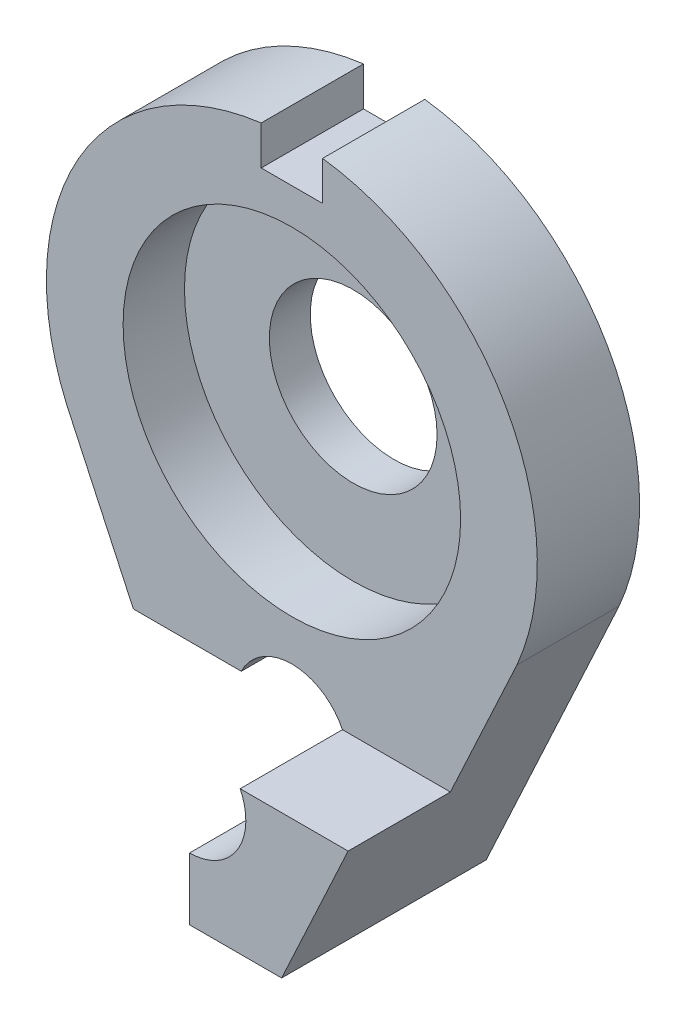
ISO-10303-21;
HEADER;
FILE_DESCRIPTION(('STEP AP214'),'2;1');
FILE_NAME('part.step','',(''),(''),'','','');
FILE_SCHEMA(('AUTOMOTIVE_DESIGN { 1 0 10303 214 1 1 1 1 }'));
ENDSEC;
DATA;
#1=APPLICATION_CONTEXT('core data for automotive mechanical design processes');
#2=APPLICATION_PROTOCOL_DEFINITION('international standard','automotive_design',2000,#1);
#3=PRODUCT_CONTEXT('',#1,'mechanical');
#4=PRODUCT('Part','Part','',(#3));
#5=PRODUCT_RELATED_PRODUCT_CATEGORY('part','',(#4));
#6=PRODUCT_DEFINITION_FORMATION('','',#4);
#7=PRODUCT_DEFINITION_CONTEXT('part definition',#1,'design');
#8=PRODUCT_DEFINITION('design','',#6,#7);
#9=PRODUCT_DEFINITION_SHAPE('','',#8);
#10=(LENGTH_UNIT() NAMED_UNIT(*) SI_UNIT(.MILLI.,.METRE.));
#11=(NAMED_UNIT(*) PLANE_ANGLE_UNIT() SI_UNIT($,.RADIAN.));
#12=(NAMED_UNIT(*) SI_UNIT($,.STERADIAN.) SOLID_ANGLE_UNIT());
#13=UNCERTAINTY_MEASURE_WITH_UNIT(LENGTH_MEASURE(1.E-05),#10,'distance_accuracy_value','');
#14=(GEOMETRIC_REPRESENTATION_CONTEXT(3) GLOBAL_UNCERTAINTY_ASSIGNED_CONTEXT((#13)) GLOBAL_UNIT_ASSIGNED_CONTEXT((#10,
#11,#12)) REPRESENTATION_CONTEXT('',''));
#15=CARTESIAN_POINT('',(0.,0.,0.));
#16=DIRECTION('',(0.,0.,1.));
#17=DIRECTION('',(1.,0.,0.));
#18=AXIS2_PLACEMENT_3D('',#15,#16,#17);
#19=CARTESIAN_POINT('',(0.,0.,5.));
#20=DIRECTION('',(0.,0.,-1.));
#21=DIRECTION('',(-1.,0.,0.));
#22=AXIS2_PLACEMENT_3D('',#19,#20,#21);
#23=PLANE('',#22);
#24=CARTESIAN_POINT('',(0.,0.,5.));
#25=DIRECTION('',(0.,0.,1.));
#26=DIRECTION('',(1.,0.,0.));
#27=AXIS2_PLACEMENT_3D('',#24,#25,#26);
#28=CIRCLE('',#27,8.25);
#29=CARTESIAN_POINT('',(8.25,0.,5.));
#30=VERTEX_POINT('',#29);
#31=EDGE_CURVE('E191',#30,#30,#28,.T.);
#32=ORIENTED_EDGE('',*,*,#31,.F.);
#33=EDGE_LOOP('',(#32));
#34=FACE_BOUND('',#33,.T.);
#35=DIRECTION('',(-1.,0.,0.));
#36=VECTOR('',#35,1.);
#37=CARTESIAN_POINT('',(0.,-11.7958315233128,5.));
#38=LINE('',#37,#36);
#39=CARTESIAN_POINT('',(-2.47234267037416,-11.7958315233128,5.));
#40=VERTEX_POINT('',#39);
#41=CARTESIAN_POINT('',(-7.75,-11.7958315233128,5.));
#42=VERTEX_POINT('',#41);
#43=EDGE_CURVE('E148',#40,#42,#38,.T.);
#44=ORIENTED_EDGE('',*,*,#43,.F.);
#45=CARTESIAN_POINT('',(0.,-13.,5.));
#46=DIRECTION('',(0.,0.,-1.));
#47=DIRECTION('',(-1.,0.,0.));
#48=AXIS2_PLACEMENT_3D('',#45,#46,#47);
#49=CIRCLE('',#48,2.75);
#50=CARTESIAN_POINT('',(2.47234267037417,-11.7958315233128,5.));
#51=VERTEX_POINT('',#50);
#52=EDGE_CURVE('E47',#40,#51,#49,.T.);
#53=ORIENTED_EDGE('',*,*,#52,.T.);
#54=DIRECTION('',(-1.,0.,0.));
#55=VECTOR('',#54,1.);
#56=CARTESIAN_POINT('',(7.74999999999997,-11.7958315233128,5.));
#57=LINE('',#56,#55);
#58=CARTESIAN_POINT('',(7.74999999999997,-11.7958315233128,5.));
#59=VERTEX_POINT('',#58);
#60=EDGE_CURVE('E53',#59,#51,#57,.T.);
#61=ORIENTED_EDGE('',*,*,#60,.F.);
#62=DIRECTION('',(0.421111306454627,0.907008967748433,0.));
#63=VECTOR('',#62,1.);
#64=CARTESIAN_POINT('',(11.,-4.79583152331272,5.));
#65=LINE('',#64,#63);
#66=CARTESIAN_POINT('',(11.,-4.79583152331272,5.));
#67=VERTEX_POINT('',#66);
#68=EDGE_CURVE('E209',#59,#67,#65,.T.);
#69=ORIENTED_EDGE('',*,*,#68,.T.);
#70=CARTESIAN_POINT('',(0.,0.,5.));
#71=DIRECTION('',(0.,0.,1.));
#72=DIRECTION('',(-1.,0.,0.));
#73=AXIS2_PLACEMENT_3D('',#70,#71,#72);
#74=CIRCLE('',#73,12.);
#75=CARTESIAN_POINT('',(1.5,11.9058808997907,5.));
#76=VERTEX_POINT('',#75);
#77=EDGE_CURVE('E202',#67,#76,#74,.T.);
#78=ORIENTED_EDGE('',*,*,#77,.T.);
#79=DIRECTION('',(0.,1.,0.));
#80=VECTOR('',#79,1.);
#81=CARTESIAN_POINT('',(1.5,10.,5.));
#82=LINE('',#81,#80);
#83=CARTESIAN_POINT('',(1.5,10.,5.));
#84=VERTEX_POINT('',#83);
#85=EDGE_CURVE('E181',#84,#76,#82,.T.);
#86=ORIENTED_EDGE('',*,*,#85,.F.);
#87=DIRECTION('',(-1.,0.,0.));
#88=VECTOR('',#87,1.);
#89=CARTESIAN_POINT('',(1.5,10.,5.));
#90=LINE('',#89,#88);
#91=CARTESIAN_POINT('',(-1.5,10.,5.));
#92=VERTEX_POINT('',#91);
#93=EDGE_CURVE('E170',#84,#92,#90,.T.);
#94=ORIENTED_EDGE('',*,*,#93,.T.);
#95=DIRECTION('',(0.,1.,0.));
#96=VECTOR('',#95,1.);
#97=CARTESIAN_POINT('',(-1.5,10.,5.));
#98=LINE('',#97,#96);
#99=CARTESIAN_POINT('',(-1.5,11.9058808997907,5.));
#100=VERTEX_POINT('',#99);
#101=EDGE_CURVE('E188',#92,#100,#98,.T.);
#102=ORIENTED_EDGE('',*,*,#101,.T.);
#103=CARTESIAN_POINT('',(-11.,-4.79583152331272,5.));
#104=VERTEX_POINT('',#103);
#105=EDGE_CURVE('E206',#100,#104,#74,.T.);
#106=ORIENTED_EDGE('',*,*,#105,.T.);
#107=DIRECTION('',(0.421111306454626,-0.907008967748433,0.));
#108=VECTOR('',#107,1.);
#109=CARTESIAN_POINT('',(-11.,-4.79583152331272,5.));
#110=LINE('',#109,#108);
#111=EDGE_CURVE('E205',#104,#42,#110,.T.);
#112=ORIENTED_EDGE('',*,*,#111,.T.);
#113=EDGE_LOOP('',(#44,#53,#61,#69,#78,#86,#94,#102,#106,#112));
#114=FACE_BOUND('',#113,.T.);
#115=ADVANCED_FACE('F32',(#34,#114),#23,.F.);
#116=CARTESIAN_POINT('',(0.,0.,0.));
#117=DIRECTION('',(0.,0.,-1.));
#118=DIRECTION('',(-1.,0.,0.));
#119=AXIS2_PLACEMENT_3D('',#116,#117,#118);
#120=PLANE('',#119);
#121=CARTESIAN_POINT('',(0.,-13.,0.));
#122=DIRECTION('',(0.,0.,1.));
#123=DIRECTION('',(1.,0.,0.));
#124=AXIS2_PLACEMENT_3D('',#121,#122,#123);
#125=CIRCLE('',#124,2.75);
#126=CARTESIAN_POINT('',(0.,-15.75,0.));
#127=VERTEX_POINT('',#126);
#128=CARTESIAN_POINT('',(-2.47234267037416,-11.7958315233128,0.));
#129=VERTEX_POINT('',#128);
#130=EDGE_CURVE('E125',#127,#129,#125,.T.);
#131=ORIENTED_EDGE('',*,*,#130,.T.);
#132=DIRECTION('',(-1.,0.,0.));
#133=VECTOR('',#132,1.);
#134=CARTESIAN_POINT('',(0.,-11.7958315233128,0.));
#135=LINE('',#134,#133);
#136=CARTESIAN_POINT('',(-7.75,-11.7958315233128,0.));
#137=VERTEX_POINT('',#136);
#138=EDGE_CURVE('E135',#129,#137,#135,.T.);
#139=ORIENTED_EDGE('',*,*,#138,.T.);
#140=DIRECTION('',(0.421111306454626,-0.907008967748433,0.));
#141=VECTOR('',#140,1.);
#142=CARTESIAN_POINT('',(-11.,-4.79583152331272,0.));
#143=LINE('',#142,#141);
#144=CARTESIAN_POINT('',(-11.,-4.79583152331272,0.));
#145=VERTEX_POINT('',#144);
#146=EDGE_CURVE('E215',#145,#137,#143,.T.);
#147=ORIENTED_EDGE('',*,*,#146,.F.);
#148=CARTESIAN_POINT('',(0.,0.,0.));
#149=DIRECTION('',(0.,0.,1.));
#150=DIRECTION('',(-1.,0.,0.));
#151=AXIS2_PLACEMENT_3D('',#148,#149,#150);
#152=CIRCLE('',#151,12.);
#153=CARTESIAN_POINT('',(-1.5,11.9058808997907,0.));
#154=VERTEX_POINT('',#153);
#155=EDGE_CURVE('E201',#154,#145,#152,.T.);
#156=ORIENTED_EDGE('',*,*,#155,.F.);
#157=DIRECTION('',(0.,1.,0.));
#158=VECTOR('',#157,1.);
#159=CARTESIAN_POINT('',(-1.5,10.,0.));
#160=LINE('',#159,#158);
#161=CARTESIAN_POINT('',(-1.5,10.,0.));
#162=VERTEX_POINT('',#161);
#163=EDGE_CURVE('E186',#162,#154,#160,.T.);
#164=ORIENTED_EDGE('',*,*,#163,.F.);
#165=DIRECTION('',(-1.,0.,0.));
#166=VECTOR('',#165,1.);
#167=CARTESIAN_POINT('',(1.5,10.,0.));
#168=LINE('',#167,#166);
#169=CARTESIAN_POINT('',(1.5,10.,0.));
#170=VERTEX_POINT('',#169);
#171=EDGE_CURVE('E175',#170,#162,#168,.T.);
#172=ORIENTED_EDGE('',*,*,#171,.F.);
#173=DIRECTION('',(0.,1.,0.));
#174=VECTOR('',#173,1.);
#175=CARTESIAN_POINT('',(1.5,10.,0.));
#176=LINE('',#175,#174);
#177=CARTESIAN_POINT('',(1.5,11.9058808997907,0.));
#178=VERTEX_POINT('',#177);
#179=EDGE_CURVE('E183',#170,#178,#176,.T.);
#180=ORIENTED_EDGE('',*,*,#179,.T.);
#181=CARTESIAN_POINT('',(11.,-4.79583152331272,0.));
#182=VERTEX_POINT('',#181);
#183=EDGE_CURVE('E212',#182,#178,#152,.T.);
#184=ORIENTED_EDGE('',*,*,#183,.F.);
#185=DIRECTION('',(0.421111306454627,0.907008967748433,0.));
#186=VECTOR('',#185,1.);
#187=CARTESIAN_POINT('',(11.,-4.79583152331272,0.));
#188=LINE('',#187,#186);
#189=CARTESIAN_POINT('',(4.5,-18.7958315233128,0.));
#190=VERTEX_POINT('',#189);
#191=EDGE_CURVE('E219',#190,#182,#188,.T.);
#192=ORIENTED_EDGE('',*,*,#191,.F.);
#193=DIRECTION('',(1.,0.,0.));
#194=VECTOR('',#193,1.);
#195=CARTESIAN_POINT('',(-4.50000000000001,-18.7958315233128,0.));
#196=LINE('',#195,#194);
#197=CARTESIAN_POINT('',(0.,-18.7958315233128,0.));
#198=VERTEX_POINT('',#197);
#199=EDGE_CURVE('E217',#198,#190,#196,.T.);
#200=ORIENTED_EDGE('',*,*,#199,.F.);
#201=DIRECTION('',(0.,1.,0.));
#202=VECTOR('',#201,1.);
#203=CARTESIAN_POINT('',(0.,-18.7958315233128,0.));
#204=LINE('',#203,#202);
#205=EDGE_CURVE('E139',#198,#127,#204,.T.);
#206=ORIENTED_EDGE('',*,*,#205,.T.);
#207=EDGE_LOOP('',(#131,#139,#147,#156,#164,#172,#180,#184,#192,#200,#206));
#208=FACE_BOUND('',#207,.T.);
#209=CARTESIAN_POINT('',(0.,0.,0.));
#210=DIRECTION('',(0.,0.,1.));
#211=DIRECTION('',(1.,0.,0.));
#212=AXIS2_PLACEMENT_3D('',#209,#210,#211);
#213=CIRCLE('',#212,4.1);
#214=CARTESIAN_POINT('',(4.1,0.,0.));
#215=VERTEX_POINT('',#214);
#216=EDGE_CURVE('E198',#215,#215,#213,.T.);
#217=ORIENTED_EDGE('',*,*,#216,.T.);
#218=EDGE_LOOP('',(#217));
#219=FACE_BOUND('',#218,.T.);
#220=ADVANCED_FACE('F132',(#208,#219),#120,.T.);
#221=CARTESIAN_POINT('',(0.,0.,5.));
#222=DIRECTION('',(0.,0.,-1.));
#223=DIRECTION('',(-1.,0.,0.));
#224=AXIS2_PLACEMENT_3D('',#221,#222,#223);
#225=CYLINDRICAL_SURFACE('',#224,12.);
#226=DIRECTION('',(0.,0.,-1.));
#227=VECTOR('',#226,1.);
#228=CARTESIAN_POINT('',(-1.5,11.9058808997907,5.));
#229=LINE('',#228,#227);
#230=EDGE_CURVE('E40',#154,#100,#229,.F.);
#231=ORIENTED_EDGE('',*,*,#230,.F.);
#232=ORIENTED_EDGE('',*,*,#155,.T.);
#233=DIRECTION('',(0.,0.,-1.));
#234=VECTOR('',#233,1.);
#235=CARTESIAN_POINT('',(-11.,-4.79583152331272,5.));
#236=LINE('',#235,#234);
#237=EDGE_CURVE('E226',#104,#145,#236,.T.);
#238=ORIENTED_EDGE('',*,*,#237,.F.);
#239=ORIENTED_EDGE('',*,*,#105,.F.);
#240=EDGE_LOOP('',(#231,#232,#238,#239));
#241=FACE_BOUND('',#240,.T.);
#242=ADVANCED_FACE('F34',(#241),#225,.T.);
#243=ORIENTED_EDGE('',*,*,#183,.T.);
#244=DIRECTION('',(0.,0.,-1.));
#245=VECTOR('',#244,1.);
#246=CARTESIAN_POINT('',(1.5,11.9058808997907,5.));
#247=LINE('',#246,#245);
#248=EDGE_CURVE('E229',#178,#76,#247,.F.);
#249=ORIENTED_EDGE('',*,*,#248,.T.);
#250=ORIENTED_EDGE('',*,*,#77,.F.);
#251=DIRECTION('',(0.,0.,-1.));
#252=VECTOR('',#251,1.);
#253=CARTESIAN_POINT('',(11.,-4.79583152331272,5.));
#254=LINE('',#253,#252);
#255=EDGE_CURVE('E211',#67,#182,#254,.T.);
#256=ORIENTED_EDGE('',*,*,#255,.T.);
#257=EDGE_LOOP('',(#243,#249,#250,#256));
#258=FACE_BOUND('',#257,.T.);
#259=ADVANCED_FACE('F259',(#258),#225,.T.);
#260=CARTESIAN_POINT('',(0.,0.,5.));
#261=DIRECTION('',(0.,0.,-1.));
#262=DIRECTION('',(-1.,0.,0.));
#263=AXIS2_PLACEMENT_3D('',#260,#261,#262);
#264=CYLINDRICAL_SURFACE('',#263,4.1);
#265=ORIENTED_EDGE('',*,*,#216,.F.);
#266=EDGE_LOOP('',(#265));
#267=FACE_BOUND('',#266,.T.);
#268=CARTESIAN_POINT('',(0.,0.,2.));
#269=DIRECTION('',(0.,0.,1.));
#270=DIRECTION('',(1.,0.,0.));
#271=AXIS2_PLACEMENT_3D('',#268,#269,#270);
#272=CIRCLE('',#271,4.1);
#273=CARTESIAN_POINT('',(4.1,0.,2.));
#274=VERTEX_POINT('',#273);
#275=EDGE_CURVE('E195',#274,#274,#272,.T.);
#276=ORIENTED_EDGE('',*,*,#275,.T.);
#277=EDGE_LOOP('',(#276));
#278=FACE_BOUND('',#277,.T.);
#279=ADVANCED_FACE('F289',(#267,#278),#264,.F.);
#280=CARTESIAN_POINT('',(-11.,-4.79583152331272,5.));
#281=DIRECTION('',(0.907008967748433,0.421111306454626,0.));
#282=DIRECTION('',(-0.421111306454626,0.907008967748433,0.));
#283=AXIS2_PLACEMENT_3D('',#280,#281,#282);
#284=PLANE('',#283);
#285=ORIENTED_EDGE('',*,*,#146,.T.);
#286=DIRECTION('',(0.,0.,1.));
#287=VECTOR('',#286,1.);
#288=CARTESIAN_POINT('',(-7.75,-11.7958315233128,0.));
#289=LINE('',#288,#287);
#290=EDGE_CURVE('E144',#137,#42,#289,.T.);
#291=ORIENTED_EDGE('',*,*,#290,.T.);
#292=ORIENTED_EDGE('',*,*,#111,.F.);
#293=ORIENTED_EDGE('',*,*,#237,.T.);
#294=EDGE_LOOP('',(#285,#291,#292,#293));
#295=FACE_BOUND('',#294,.T.);
#296=ADVANCED_FACE('F245',(#295),#284,.F.);
#297=CARTESIAN_POINT('',(-4.50000000000001,-18.7958315233128,5.));
#298=DIRECTION('',(0.,1.,0.));
#299=DIRECTION('',(0.,0.,1.));
#300=AXIS2_PLACEMENT_3D('',#297,#298,#299);
#301=PLANE('',#300);
#302=DIRECTION('',(0.,0.,-1.));
#303=VECTOR('',#302,1.);
#304=CARTESIAN_POINT('',(0.,-18.7958315233128,10.));
#305=LINE('',#304,#303);
#306=CARTESIAN_POINT('',(0.,-18.7958315233128,10.));
#307=VERTEX_POINT('',#306);
#308=EDGE_CURVE('E168',#307,#198,#305,.T.);
#309=ORIENTED_EDGE('',*,*,#308,.T.);
#310=ORIENTED_EDGE('',*,*,#199,.T.);
#311=DIRECTION('',(0.,0.,-1.));
#312=VECTOR('',#311,1.);
#313=CARTESIAN_POINT('',(4.5,-18.7958315233128,5.));
#314=LINE('',#313,#312);
#315=CARTESIAN_POINT('',(4.5,-18.7958315233128,10.));
#316=VERTEX_POINT('',#315);
#317=EDGE_CURVE('E223',#316,#190,#314,.T.);
#318=ORIENTED_EDGE('',*,*,#317,.F.);
#319=DIRECTION('',(1.,0.,0.));
#320=VECTOR('',#319,1.);
#321=CARTESIAN_POINT('',(0.,-18.7958315233128,10.));
#322=LINE('',#321,#320);
#323=EDGE_CURVE('E156',#307,#316,#322,.T.);
#324=ORIENTED_EDGE('',*,*,#323,.F.);
#325=EDGE_LOOP('',(#309,#310,#318,#324));
#326=FACE_BOUND('',#325,.T.);
#327=ADVANCED_FACE('F295',(#326),#301,.F.);
#328=CARTESIAN_POINT('',(11.,-4.79583152331272,5.));
#329=DIRECTION('',(-0.907008967748433,0.421111306454627,0.));
#330=DIRECTION('',(-0.421111306454627,-0.907008967748433,0.));
#331=AXIS2_PLACEMENT_3D('',#328,#329,#330);
#332=PLANE('',#331);
#333=ORIENTED_EDGE('',*,*,#191,.T.);
#334=ORIENTED_EDGE('',*,*,#255,.F.);
#335=ORIENTED_EDGE('',*,*,#68,.F.);
#336=DIRECTION('',(0.,0.,-1.));
#337=VECTOR('',#336,1.);
#338=CARTESIAN_POINT('',(7.74999999999997,-11.7958315233128,10.));
#339=LINE('',#338,#337);
#340=CARTESIAN_POINT('',(7.74999999999997,-11.7958315233128,10.));
#341=VERTEX_POINT('',#340);
#342=EDGE_CURVE('E164',#341,#59,#339,.T.);
#343=ORIENTED_EDGE('',*,*,#342,.F.);
#344=DIRECTION('',(0.421111306454627,0.907008967748433,0.));
#345=VECTOR('',#344,1.);
#346=CARTESIAN_POINT('',(4.5,-18.7958315233128,10.));
#347=LINE('',#346,#345);
#348=EDGE_CURVE('E159',#316,#341,#347,.T.);
#349=ORIENTED_EDGE('',*,*,#348,.F.);
#350=ORIENTED_EDGE('',*,*,#317,.T.);
#351=EDGE_LOOP('',(#333,#334,#335,#343,#349,#350));
#352=FACE_BOUND('',#351,.T.);
#353=ADVANCED_FACE('F255',(#352),#332,.F.);
#354=CARTESIAN_POINT('',(0.,0.,2.));
#355=DIRECTION('',(0.,0.,1.));
#356=DIRECTION('',(1.,0.,0.));
#357=AXIS2_PLACEMENT_3D('',#354,#355,#356);
#358=CYLINDRICAL_SURFACE('',#357,8.25);
#359=CARTESIAN_POINT('',(0.,0.,2.));
#360=DIRECTION('',(0.,0.,1.));
#361=DIRECTION('',(1.,0.,0.));
#362=AXIS2_PLACEMENT_3D('',#359,#360,#361);
#363=CIRCLE('',#362,8.25);
#364=CARTESIAN_POINT('',(8.25,0.,2.));
#365=VERTEX_POINT('',#364);
#366=EDGE_CURVE('E192',#365,#365,#363,.T.);
#367=ORIENTED_EDGE('',*,*,#366,.F.);
#368=EDGE_LOOP('',(#367));
#369=FACE_BOUND('',#368,.T.);
#370=ORIENTED_EDGE('',*,*,#31,.T.);
#371=EDGE_LOOP('',(#370));
#372=FACE_BOUND('',#371,.T.);
#373=ADVANCED_FACE('F294',(#369,#372),#358,.F.);
#374=CARTESIAN_POINT('',(0.,0.,2.));
#375=DIRECTION('',(0.,0.,1.));
#376=DIRECTION('',(1.,0.,0.));
#377=AXIS2_PLACEMENT_3D('',#374,#375,#376);
#378=PLANE('',#377);
#379=ORIENTED_EDGE('',*,*,#275,.F.);
#380=EDGE_LOOP('',(#379));
#381=FACE_BOUND('',#380,.T.);
#382=ORIENTED_EDGE('',*,*,#366,.T.);
#383=EDGE_LOOP('',(#382));
#384=FACE_BOUND('',#383,.T.);
#385=ADVANCED_FACE('F310',(#381,#384),#378,.T.);
#386=CARTESIAN_POINT('',(-1.5,10.,5.));
#387=DIRECTION('',(1.,0.,0.));
#388=DIRECTION('',(0.,0.,-1.));
#389=AXIS2_PLACEMENT_3D('',#386,#387,#388);
#390=PLANE('',#389);
#391=ORIENTED_EDGE('',*,*,#230,.T.);
#392=ORIENTED_EDGE('',*,*,#101,.F.);
#393=DIRECTION('',(0.,0.,-1.));
#394=VECTOR('',#393,1.);
#395=CARTESIAN_POINT('',(-1.5,10.,5.));
#396=LINE('',#395,#394);
#397=EDGE_CURVE('E173',#92,#162,#396,.T.);
#398=ORIENTED_EDGE('',*,*,#397,.T.);
#399=ORIENTED_EDGE('',*,*,#163,.T.);
#400=EDGE_LOOP('',(#391,#392,#398,#399));
#401=FACE_BOUND('',#400,.T.);
#402=ADVANCED_FACE('F236',(#401),#390,.T.);
#403=CARTESIAN_POINT('',(1.5,10.,5.));
#404=DIRECTION('',(1.,0.,0.));
#405=DIRECTION('',(0.,0.,-1.));
#406=AXIS2_PLACEMENT_3D('',#403,#404,#405);
#407=PLANE('',#406);
#408=ORIENTED_EDGE('',*,*,#179,.F.);
#409=DIRECTION('',(0.,0.,-1.));
#410=VECTOR('',#409,1.);
#411=CARTESIAN_POINT('',(1.5,10.,5.));
#412=LINE('',#411,#410);
#413=EDGE_CURVE('E178',#84,#170,#412,.T.);
#414=ORIENTED_EDGE('',*,*,#413,.F.);
#415=ORIENTED_EDGE('',*,*,#85,.T.);
#416=ORIENTED_EDGE('',*,*,#248,.F.);
#417=EDGE_LOOP('',(#408,#414,#415,#416));
#418=FACE_BOUND('',#417,.T.);
#419=ADVANCED_FACE('F262',(#418),#407,.F.);
#420=CARTESIAN_POINT('',(0.,10.,0.));
#421=DIRECTION('',(0.,-1.,0.));
#422=DIRECTION('',(0.,0.,-1.));
#423=AXIS2_PLACEMENT_3D('',#420,#421,#422);
#424=PLANE('',#423);
#425=ORIENTED_EDGE('',*,*,#93,.F.);
#426=ORIENTED_EDGE('',*,*,#413,.T.);
#427=ORIENTED_EDGE('',*,*,#171,.T.);
#428=ORIENTED_EDGE('',*,*,#397,.F.);
#429=EDGE_LOOP('',(#425,#426,#427,#428));
#430=FACE_BOUND('',#429,.T.);
#431=ADVANCED_FACE('F267',(#430),#424,.F.);
#432=CARTESIAN_POINT('',(0.,-11.7958315233128,10.));
#433=DIRECTION('',(1.,0.,0.));
#434=DIRECTION('',(0.,1.,0.));
#435=AXIS2_PLACEMENT_3D('',#432,#433,#434);
#436=PLANE('',#435);
#437=DIRECTION('',(0.,-1.,0.));
#438=VECTOR('',#437,1.);
#439=CARTESIAN_POINT('',(0.,-11.7958315233128,10.));
#440=LINE('',#439,#438);
#441=CARTESIAN_POINT('',(0.,-15.75,10.));
#442=VERTEX_POINT('',#441);
#443=EDGE_CURVE('E154',#442,#307,#440,.T.);
#444=ORIENTED_EDGE('',*,*,#443,.F.);
#445=DIRECTION('',(0.,0.,1.));
#446=VECTOR('',#445,1.);
#447=CARTESIAN_POINT('',(0.,-15.75,0.));
#448=LINE('',#447,#446);
#449=EDGE_CURVE('E152',#442,#127,#448,.F.);
#450=ORIENTED_EDGE('',*,*,#449,.T.);
#451=ORIENTED_EDGE('',*,*,#205,.F.);
#452=ORIENTED_EDGE('',*,*,#308,.F.);
#453=EDGE_LOOP('',(#444,#450,#451,#452));
#454=FACE_BOUND('',#453,.T.);
#455=ADVANCED_FACE('F269',(#454),#436,.F.);
#456=CARTESIAN_POINT('',(7.74999999999997,-11.7958315233128,10.));
#457=DIRECTION('',(0.,-1.,0.));
#458=DIRECTION('',(0.,0.,-1.));
#459=AXIS2_PLACEMENT_3D('',#456,#457,#458);
#460=PLANE('',#459);
#461=ORIENTED_EDGE('',*,*,#60,.T.);
#462=DIRECTION('',(0.,0.,1.));
#463=VECTOR('',#462,1.);
#464=CARTESIAN_POINT('',(2.47234267037417,-11.7958315233128,0.));
#465=LINE('',#464,#463);
#466=CARTESIAN_POINT('',(2.47234267037417,-11.7958315233128,10.));
#467=VERTEX_POINT('',#466);
#468=EDGE_CURVE('E246',#51,#467,#465,.T.);
#469=ORIENTED_EDGE('',*,*,#468,.T.);
#470=DIRECTION('',(-1.,0.,0.));
#471=VECTOR('',#470,1.);
#472=CARTESIAN_POINT('',(7.74999999999997,-11.7958315233128,10.));
#473=LINE('',#472,#471);
#474=EDGE_CURVE('E161',#341,#467,#473,.T.);
#475=ORIENTED_EDGE('',*,*,#474,.F.);
#476=ORIENTED_EDGE('',*,*,#342,.T.);
#477=EDGE_LOOP('',(#461,#469,#475,#476));
#478=FACE_BOUND('',#477,.T.);
#479=ADVANCED_FACE('F250',(#478),#460,.F.);
#480=CARTESIAN_POINT('',(0.,0.,10.));
#481=DIRECTION('',(0.,0.,1.));
#482=DIRECTION('',(1.,0.,0.));
#483=AXIS2_PLACEMENT_3D('',#480,#481,#482);
#484=PLANE('',#483);
#485=CARTESIAN_POINT('',(0.,-13.,10.));
#486=DIRECTION('',(0.,0.,1.));
#487=DIRECTION('',(1.,0.,0.));
#488=AXIS2_PLACEMENT_3D('',#485,#486,#487);
#489=CIRCLE('',#488,2.75);
#490=EDGE_CURVE('E140',#442,#467,#489,.T.);
#491=ORIENTED_EDGE('',*,*,#490,.F.);
#492=ORIENTED_EDGE('',*,*,#443,.T.);
#493=ORIENTED_EDGE('',*,*,#323,.T.);
#494=ORIENTED_EDGE('',*,*,#348,.T.);
#495=ORIENTED_EDGE('',*,*,#474,.T.);
#496=EDGE_LOOP('',(#491,#492,#493,#494,#495));
#497=FACE_BOUND('',#496,.T.);
#498=ADVANCED_FACE('F402',(#497),#484,.T.);
#499=CARTESIAN_POINT('',(0.,-11.7958315233128,0.));
#500=DIRECTION('',(0.,1.,0.));
#501=DIRECTION('',(-1.,0.,0.));
#502=AXIS2_PLACEMENT_3D('',#499,#500,#501);
#503=PLANE('',#502);
#504=ORIENTED_EDGE('',*,*,#138,.F.);
#505=DIRECTION('',(0.,0.,1.));
#506=VECTOR('',#505,1.);
#507=CARTESIAN_POINT('',(-2.47234267037416,-11.7958315233128,0.));
#508=LINE('',#507,#506);
#509=EDGE_CURVE('E11',#129,#40,#508,.T.);
#510=ORIENTED_EDGE('',*,*,#509,.T.);
#511=ORIENTED_EDGE('',*,*,#43,.T.);
#512=ORIENTED_EDGE('',*,*,#290,.F.);
#513=EDGE_LOOP('',(#504,#510,#511,#512));
#514=FACE_BOUND('',#513,.T.);
#515=ADVANCED_FACE('F142',(#514),#503,.F.);
#516=CARTESIAN_POINT('',(0.,-13.,0.));
#517=DIRECTION('',(0.,0.,1.));
#518=DIRECTION('',(1.,0.,0.));
#519=AXIS2_PLACEMENT_3D('',#516,#517,#518);
#520=CYLINDRICAL_SURFACE('',#519,2.75);
#521=ORIENTED_EDGE('',*,*,#490,.T.);
#522=ORIENTED_EDGE('',*,*,#468,.F.);
#523=ORIENTED_EDGE('',*,*,#52,.F.);
#524=ORIENTED_EDGE('',*,*,#509,.F.);
#525=ORIENTED_EDGE('',*,*,#130,.F.);
#526=ORIENTED_EDGE('',*,*,#449,.F.);
#527=EDGE_LOOP('',(#521,#522,#523,#524,#525,#526));
#528=FACE_BOUND('',#527,.T.);
#529=ADVANCED_FACE('F124',(#528),#520,.F.);
#530=CLOSED_SHELL('',(#115,#220,#242,#259,#279,#296,#327,#353,#373,#385,#402,#419,#431,#455,
#479,#498,#515,#529));
#531=MANIFOLD_SOLID_BREP('B2',#530);
#532=ADVANCED_BREP_SHAPE_REPRESENTATION('',(#18,#531),#14);
#533=SHAPE_DEFINITION_REPRESENTATION(#9,#532);
ENDSEC;
END-ISO-10303-21;
